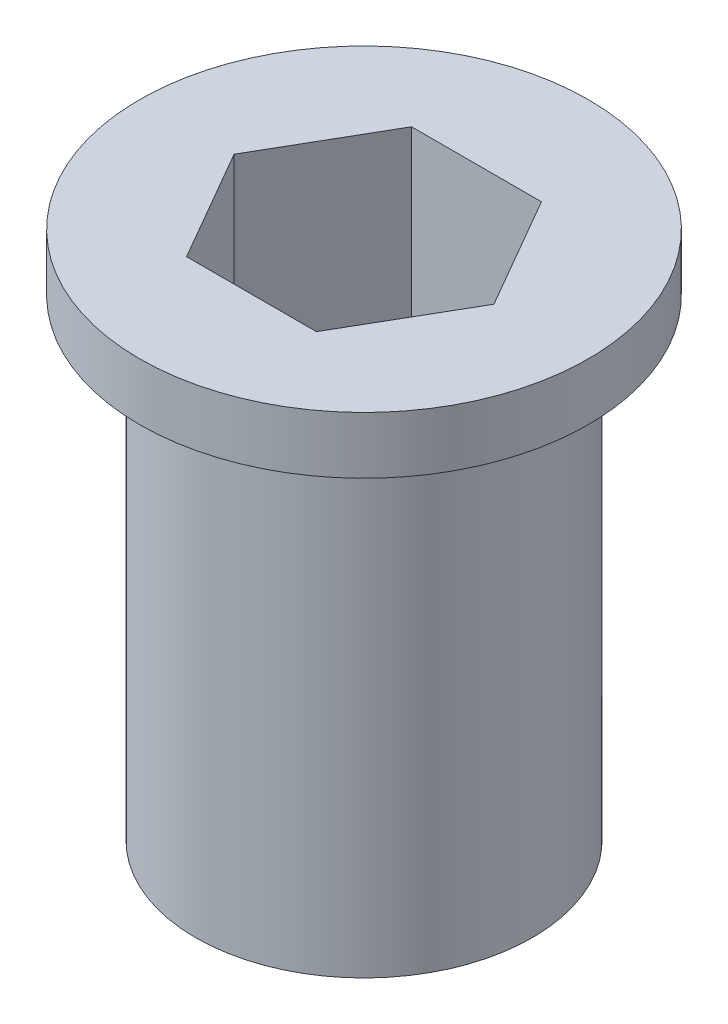
ISO-10303-21;
HEADER;
FILE_DESCRIPTION(('STEP AP214'),'2;1');
FILE_NAME('part.step','',(''),(''),'','','');
FILE_SCHEMA(('AUTOMOTIVE_DESIGN { 1 0 10303 214 1 1 1 1 }'));
ENDSEC;
DATA;
#1=APPLICATION_CONTEXT('core data for automotive mechanical design processes');
#2=APPLICATION_PROTOCOL_DEFINITION('international standard','automotive_design',2000,#1);
#3=PRODUCT_CONTEXT('',#1,'mechanical');
#4=PRODUCT('Part','Part','',(#3));
#5=PRODUCT_RELATED_PRODUCT_CATEGORY('part','',(#4));
#6=PRODUCT_DEFINITION_FORMATION('','',#4);
#7=PRODUCT_DEFINITION_CONTEXT('part definition',#1,'design');
#8=PRODUCT_DEFINITION('design','',#6,#7);
#9=PRODUCT_DEFINITION_SHAPE('','',#8);
#10=(LENGTH_UNIT() NAMED_UNIT(*) SI_UNIT(.MILLI.,.METRE.));
#11=(NAMED_UNIT(*) PLANE_ANGLE_UNIT() SI_UNIT($,.RADIAN.));
#12=(NAMED_UNIT(*) SI_UNIT($,.STERADIAN.) SOLID_ANGLE_UNIT());
#13=UNCERTAINTY_MEASURE_WITH_UNIT(LENGTH_MEASURE(1.E-05),#10,'distance_accuracy_value','');
#14=(GEOMETRIC_REPRESENTATION_CONTEXT(3) GLOBAL_UNCERTAINTY_ASSIGNED_CONTEXT((#13)) GLOBAL_UNIT_ASSIGNED_CONTEXT((#10,
#11,#12)) REPRESENTATION_CONTEXT('',''));
#15=CARTESIAN_POINT('',(0.,0.,0.));
#16=DIRECTION('',(0.,0.,1.));
#17=DIRECTION('',(1.,0.,0.));
#18=AXIS2_PLACEMENT_3D('',#15,#16,#17);
#19=CARTESIAN_POINT('',(-4.34095233646949,-21.05,2.50624999999998));
#20=DIRECTION('',(-0.86602540378444,0.,0.499999999999998));
#21=DIRECTION('',(0.499999999999998,0.,0.86602540378444));
#22=AXIS2_PLACEMENT_3D('',#19,#20,#21);
#23=PLANE('',#22);
#24=DIRECTION('',(0.,1.,0.));
#25=VECTOR('',#24,1.);
#26=CARTESIAN_POINT('',(-5.78793644862597,-21.05,0.));
#27=LINE('',#26,#25);
#28=CARTESIAN_POINT('',(-5.78793644862597,-21.05,0.));
#29=VERTEX_POINT('',#28);
#30=CARTESIAN_POINT('',(-5.78793644862597,2.54,0.));
#31=VERTEX_POINT('',#30);
#32=EDGE_CURVE('E46',#29,#31,#27,.T.);
#33=ORIENTED_EDGE('',*,*,#32,.T.);
#34=DIRECTION('',(0.499999999999998,0.,0.86602540378444));
#35=VECTOR('',#34,1.);
#36=CARTESIAN_POINT('',(-4.34095233646949,2.54,2.50624999999998));
#37=LINE('',#36,#35);
#38=CARTESIAN_POINT('',(-2.89396822431298,2.54,5.0125));
#39=VERTEX_POINT('',#38);
#40=EDGE_CURVE('E96',#31,#39,#37,.T.);
#41=ORIENTED_EDGE('',*,*,#40,.T.);
#42=DIRECTION('',(0.,1.,0.));
#43=VECTOR('',#42,1.);
#44=CARTESIAN_POINT('',(-2.89396822431298,-21.05,5.0125));
#45=LINE('',#44,#43);
#46=CARTESIAN_POINT('',(-2.89396822431298,-21.05,5.0125));
#47=VERTEX_POINT('',#46);
#48=EDGE_CURVE('E11',#47,#39,#45,.T.);
#49=ORIENTED_EDGE('',*,*,#48,.F.);
#50=DIRECTION('',(0.499999999999998,0.,0.86602540378444));
#51=VECTOR('',#50,1.);
#52=CARTESIAN_POINT('',(-4.34095233646949,-21.05,2.50624999999998));
#53=LINE('',#52,#51);
#54=EDGE_CURVE('E98',#29,#47,#53,.T.);
#55=ORIENTED_EDGE('',*,*,#54,.F.);
#56=EDGE_LOOP('',(#33,#41,#49,#55));
#57=FACE_BOUND('',#56,.T.);
#58=ADVANCED_FACE('F43',(#57),#23,.F.);
#59=CARTESIAN_POINT('',(0.,-21.05,5.0125));
#60=DIRECTION('',(0.,0.,1.));
#61=DIRECTION('',(1.,0.,0.));
#62=AXIS2_PLACEMENT_3D('',#59,#60,#61);
#63=PLANE('',#62);
#64=ORIENTED_EDGE('',*,*,#48,.T.);
#65=DIRECTION('',(1.,0.,0.));
#66=VECTOR('',#65,1.);
#67=CARTESIAN_POINT('',(0.,2.54,5.0125));
#68=LINE('',#67,#66);
#69=CARTESIAN_POINT('',(2.89396822431301,2.54,5.0125));
#70=VERTEX_POINT('',#69);
#71=EDGE_CURVE('E112',#39,#70,#68,.T.);
#72=ORIENTED_EDGE('',*,*,#71,.T.);
#73=DIRECTION('',(0.,1.,0.));
#74=VECTOR('',#73,1.);
#75=CARTESIAN_POINT('',(2.89396822431301,-21.05,5.0125));
#76=LINE('',#75,#74);
#77=CARTESIAN_POINT('',(2.89396822431301,-21.05,5.0125));
#78=VERTEX_POINT('',#77);
#79=EDGE_CURVE('E51',#78,#70,#76,.T.);
#80=ORIENTED_EDGE('',*,*,#79,.F.);
#81=DIRECTION('',(1.,0.,0.));
#82=VECTOR('',#81,1.);
#83=CARTESIAN_POINT('',(0.,-21.05,5.0125));
#84=LINE('',#83,#82);
#85=EDGE_CURVE('E58',#47,#78,#84,.T.);
#86=ORIENTED_EDGE('',*,*,#85,.F.);
#87=EDGE_LOOP('',(#64,#72,#80,#86));
#88=FACE_BOUND('',#87,.T.);
#89=ADVANCED_FACE('F163',(#88),#63,.F.);
#90=CARTESIAN_POINT('',(4.3409523364695,-21.05,2.50624999999997));
#91=DIRECTION('',(0.866025403784441,0.,0.499999999999995));
#92=DIRECTION('',(0.499999999999995,0.,-0.866025403784441));
#93=AXIS2_PLACEMENT_3D('',#90,#91,#92);
#94=PLANE('',#93);
#95=ORIENTED_EDGE('',*,*,#79,.T.);
#96=DIRECTION('',(0.499999999999995,0.,-0.866025403784441));
#97=VECTOR('',#96,1.);
#98=CARTESIAN_POINT('',(4.3409523364695,2.54,2.50624999999997));
#99=LINE('',#98,#97);
#100=CARTESIAN_POINT('',(5.78793644862597,2.54,0.));
#101=VERTEX_POINT('',#100);
#102=EDGE_CURVE('E125',#70,#101,#99,.T.);
#103=ORIENTED_EDGE('',*,*,#102,.T.);
#104=DIRECTION('',(0.,1.,0.));
#105=VECTOR('',#104,1.);
#106=CARTESIAN_POINT('',(5.78793644862597,-21.05,0.));
#107=LINE('',#106,#105);
#108=CARTESIAN_POINT('',(5.78793644862597,-21.05,0.));
#109=VERTEX_POINT('',#108);
#110=EDGE_CURVE('E148',#109,#101,#107,.T.);
#111=ORIENTED_EDGE('',*,*,#110,.F.);
#112=DIRECTION('',(0.499999999999995,0.,-0.866025403784441));
#113=VECTOR('',#112,1.);
#114=CARTESIAN_POINT('',(4.3409523364695,-21.05,2.50624999999997));
#115=LINE('',#114,#113);
#116=EDGE_CURVE('E140',#78,#109,#115,.T.);
#117=ORIENTED_EDGE('',*,*,#116,.F.);
#118=EDGE_LOOP('',(#95,#103,#111,#117));
#119=FACE_BOUND('',#118,.T.);
#120=ADVANCED_FACE('F162',(#119),#94,.F.);
#121=CARTESIAN_POINT('',(4.34095233646949,-21.05,-2.50624999999998));
#122=DIRECTION('',(0.86602540378444,0.,-0.499999999999998));
#123=DIRECTION('',(-0.499999999999998,0.,-0.86602540378444));
#124=AXIS2_PLACEMENT_3D('',#121,#122,#123);
#125=PLANE('',#124);
#126=ORIENTED_EDGE('',*,*,#110,.T.);
#127=DIRECTION('',(-0.499999999999998,0.,-0.86602540378444));
#128=VECTOR('',#127,1.);
#129=CARTESIAN_POINT('',(4.34095233646949,2.54,-2.50624999999998));
#130=LINE('',#129,#128);
#131=CARTESIAN_POINT('',(2.89396822431298,2.54,-5.0125));
#132=VERTEX_POINT('',#131);
#133=EDGE_CURVE('E119',#101,#132,#130,.T.);
#134=ORIENTED_EDGE('',*,*,#133,.T.);
#135=DIRECTION('',(0.,1.,0.));
#136=VECTOR('',#135,1.);
#137=CARTESIAN_POINT('',(2.89396822431298,-21.05,-5.0125));
#138=LINE('',#137,#136);
#139=CARTESIAN_POINT('',(2.89396822431298,-21.05,-5.0125));
#140=VERTEX_POINT('',#139);
#141=EDGE_CURVE('E150',#140,#132,#138,.T.);
#142=ORIENTED_EDGE('',*,*,#141,.F.);
#143=DIRECTION('',(-0.499999999999998,0.,-0.86602540378444));
#144=VECTOR('',#143,1.);
#145=CARTESIAN_POINT('',(4.34095233646949,-21.05,-2.50624999999998));
#146=LINE('',#145,#144);
#147=EDGE_CURVE('E138',#109,#140,#146,.T.);
#148=ORIENTED_EDGE('',*,*,#147,.F.);
#149=EDGE_LOOP('',(#126,#134,#142,#148));
#150=FACE_BOUND('',#149,.T.);
#151=ADVANCED_FACE('F158',(#150),#125,.F.);
#152=CARTESIAN_POINT('',(0.,-21.05,-5.0125));
#153=DIRECTION('',(0.,0.,-1.));
#154=DIRECTION('',(-1.,0.,0.));
#155=AXIS2_PLACEMENT_3D('',#152,#153,#154);
#156=PLANE('',#155);
#157=ORIENTED_EDGE('',*,*,#141,.T.);
#158=DIRECTION('',(-1.,0.,0.));
#159=VECTOR('',#158,1.);
#160=CARTESIAN_POINT('',(0.,2.54,-5.0125));
#161=LINE('',#160,#159);
#162=CARTESIAN_POINT('',(-2.89396822431299,2.54,-5.0125));
#163=VERTEX_POINT('',#162);
#164=EDGE_CURVE('E117',#132,#163,#161,.T.);
#165=ORIENTED_EDGE('',*,*,#164,.T.);
#166=DIRECTION('',(0.,1.,0.));
#167=VECTOR('',#166,1.);
#168=CARTESIAN_POINT('',(-2.89396822431299,-21.05,-5.0125));
#169=LINE('',#168,#167);
#170=CARTESIAN_POINT('',(-2.89396822431299,-21.05,-5.0125));
#171=VERTEX_POINT('',#170);
#172=EDGE_CURVE('E102',#171,#163,#169,.T.);
#173=ORIENTED_EDGE('',*,*,#172,.F.);
#174=DIRECTION('',(-1.,0.,0.));
#175=VECTOR('',#174,1.);
#176=CARTESIAN_POINT('',(0.,-21.05,-5.0125));
#177=LINE('',#176,#175);
#178=EDGE_CURVE('E136',#140,#171,#177,.T.);
#179=ORIENTED_EDGE('',*,*,#178,.F.);
#180=EDGE_LOOP('',(#157,#165,#173,#179));
#181=FACE_BOUND('',#180,.T.);
#182=ADVANCED_FACE('F154',(#181),#156,.F.);
#183=CARTESIAN_POINT('',(-4.34095233646949,-21.05,-2.50624999999998));
#184=DIRECTION('',(-0.86602540378444,0.,-0.499999999999998));
#185=DIRECTION('',(-0.499999999999998,0.,0.86602540378444));
#186=AXIS2_PLACEMENT_3D('',#183,#184,#185);
#187=PLANE('',#186);
#188=ORIENTED_EDGE('',*,*,#172,.T.);
#189=DIRECTION('',(-0.499999999999998,0.,0.86602540378444));
#190=VECTOR('',#189,1.);
#191=CARTESIAN_POINT('',(-4.34095233646949,2.54,-2.50624999999998));
#192=LINE('',#191,#190);
#193=EDGE_CURVE('E108',#163,#31,#192,.T.);
#194=ORIENTED_EDGE('',*,*,#193,.T.);
#195=ORIENTED_EDGE('',*,*,#32,.F.);
#196=DIRECTION('',(-0.499999999999998,0.,0.86602540378444));
#197=VECTOR('',#196,1.);
#198=CARTESIAN_POINT('',(-4.34095233646949,-21.05,-2.50624999999998));
#199=LINE('',#198,#197);
#200=EDGE_CURVE('E134',#171,#29,#199,.T.);
#201=ORIENTED_EDGE('',*,*,#200,.F.);
#202=EDGE_LOOP('',(#188,#194,#195,#201));
#203=FACE_BOUND('',#202,.T.);
#204=ADVANCED_FACE('F115',(#203),#187,.F.);
#205=CARTESIAN_POINT('',(0.,-21.05,0.));
#206=DIRECTION('',(0.,1.,0.));
#207=DIRECTION('',(0.,0.,1.));
#208=AXIS2_PLACEMENT_3D('',#205,#206,#207);
#209=CYLINDRICAL_SURFACE('',#208,7.5);
#210=CARTESIAN_POINT('',(0.,-21.05,0.));
#211=DIRECTION('',(0.,1.,0.));
#212=DIRECTION('',(0.,0.,1.));
#213=AXIS2_PLACEMENT_3D('',#210,#211,#212);
#214=CIRCLE('',#213,7.5);
#215=CARTESIAN_POINT('',(0.,-21.05,7.5));
#216=VERTEX_POINT('',#215);
#217=EDGE_CURVE('E103',#216,#216,#214,.T.);
#218=ORIENTED_EDGE('',*,*,#217,.T.);
#219=EDGE_LOOP('',(#218));
#220=FACE_BOUND('',#219,.T.);
#221=CARTESIAN_POINT('',(0.,0.,0.));
#222=DIRECTION('',(0.,1.,0.));
#223=DIRECTION('',(0.,0.,1.));
#224=AXIS2_PLACEMENT_3D('',#221,#222,#223);
#225=CIRCLE('',#224,7.5);
#226=CARTESIAN_POINT('',(0.,0.,7.5));
#227=VERTEX_POINT('',#226);
#228=EDGE_CURVE('E129',#227,#227,#225,.T.);
#229=ORIENTED_EDGE('',*,*,#228,.F.);
#230=EDGE_LOOP('',(#229));
#231=FACE_BOUND('',#230,.T.);
#232=ADVANCED_FACE('F172',(#220,#231),#209,.T.);
#233=CARTESIAN_POINT('',(0.,-21.05,0.));
#234=DIRECTION('',(0.,1.,0.));
#235=DIRECTION('',(0.,0.,1.));
#236=AXIS2_PLACEMENT_3D('',#233,#234,#235);
#237=PLANE('',#236);
#238=ORIENTED_EDGE('',*,*,#54,.T.);
#239=ORIENTED_EDGE('',*,*,#85,.T.);
#240=ORIENTED_EDGE('',*,*,#116,.T.);
#241=ORIENTED_EDGE('',*,*,#147,.T.);
#242=ORIENTED_EDGE('',*,*,#178,.T.);
#243=ORIENTED_EDGE('',*,*,#200,.T.);
#244=EDGE_LOOP('',(#238,#239,#240,#241,#242,#243));
#245=FACE_BOUND('',#244,.T.);
#246=ORIENTED_EDGE('',*,*,#217,.F.);
#247=EDGE_LOOP('',(#246));
#248=FACE_BOUND('',#247,.T.);
#249=ADVANCED_FACE('F183',(#245,#248),#237,.F.);
#250=CARTESIAN_POINT('',(0.,2.54,0.));
#251=DIRECTION('',(0.,-1.,0.));
#252=DIRECTION('',(0.,0.,-1.));
#253=AXIS2_PLACEMENT_3D('',#250,#251,#252);
#254=CYLINDRICAL_SURFACE('',#253,10.);
#255=CARTESIAN_POINT('',(0.,2.54,0.));
#256=DIRECTION('',(0.,1.,0.));
#257=DIRECTION('',(0.,0.,1.));
#258=AXIS2_PLACEMENT_3D('',#255,#256,#257);
#259=CIRCLE('',#258,10.);
#260=CARTESIAN_POINT('',(0.,2.54,10.));
#261=VERTEX_POINT('',#260);
#262=EDGE_CURVE('E113',#261,#261,#259,.T.);
#263=ORIENTED_EDGE('',*,*,#262,.F.);
#264=EDGE_LOOP('',(#263));
#265=FACE_BOUND('',#264,.T.);
#266=CARTESIAN_POINT('',(0.,0.,0.));
#267=DIRECTION('',(0.,1.,0.));
#268=DIRECTION('',(0.,0.,1.));
#269=AXIS2_PLACEMENT_3D('',#266,#267,#268);
#270=CIRCLE('',#269,10.);
#271=CARTESIAN_POINT('',(0.,0.,10.));
#272=VERTEX_POINT('',#271);
#273=EDGE_CURVE('E130',#272,#272,#270,.T.);
#274=ORIENTED_EDGE('',*,*,#273,.T.);
#275=EDGE_LOOP('',(#274));
#276=FACE_BOUND('',#275,.T.);
#277=ADVANCED_FACE('F188',(#265,#276),#254,.T.);
#278=CARTESIAN_POINT('',(0.,2.54,0.));
#279=DIRECTION('',(0.,1.,0.));
#280=DIRECTION('',(0.,0.,1.));
#281=AXIS2_PLACEMENT_3D('',#278,#279,#280);
#282=PLANE('',#281);
#283=ORIENTED_EDGE('',*,*,#262,.T.);
#284=EDGE_LOOP('',(#283));
#285=FACE_BOUND('',#284,.T.);
#286=ORIENTED_EDGE('',*,*,#40,.F.);
#287=ORIENTED_EDGE('',*,*,#193,.F.);
#288=ORIENTED_EDGE('',*,*,#164,.F.);
#289=ORIENTED_EDGE('',*,*,#133,.F.);
#290=ORIENTED_EDGE('',*,*,#102,.F.);
#291=ORIENTED_EDGE('',*,*,#71,.F.);
#292=EDGE_LOOP('',(#286,#287,#288,#289,#290,#291));
#293=FACE_BOUND('',#292,.T.);
#294=ADVANCED_FACE('F106',(#285,#293),#282,.T.);
#295=CARTESIAN_POINT('',(0.,0.,0.));
#296=DIRECTION('',(0.,1.,0.));
#297=DIRECTION('',(0.,0.,1.));
#298=AXIS2_PLACEMENT_3D('',#295,#296,#297);
#299=PLANE('',#298);
#300=ORIENTED_EDGE('',*,*,#228,.T.);
#301=EDGE_LOOP('',(#300));
#302=FACE_BOUND('',#301,.T.);
#303=ORIENTED_EDGE('',*,*,#273,.F.);
#304=EDGE_LOOP('',(#303));
#305=FACE_BOUND('',#304,.T.);
#306=ADVANCED_FACE('F193',(#302,#305),#299,.F.);
#307=CLOSED_SHELL('',(#58,#89,#120,#151,#182,#204,#232,#249,#277,#294,#306));
#308=MANIFOLD_SOLID_BREP('B2',#307);
#309=ADVANCED_BREP_SHAPE_REPRESENTATION('',(#18,#308),#14);
#310=SHAPE_DEFINITION_REPRESENTATION(#9,#309);
ENDSEC;
END-ISO-10303-21;
